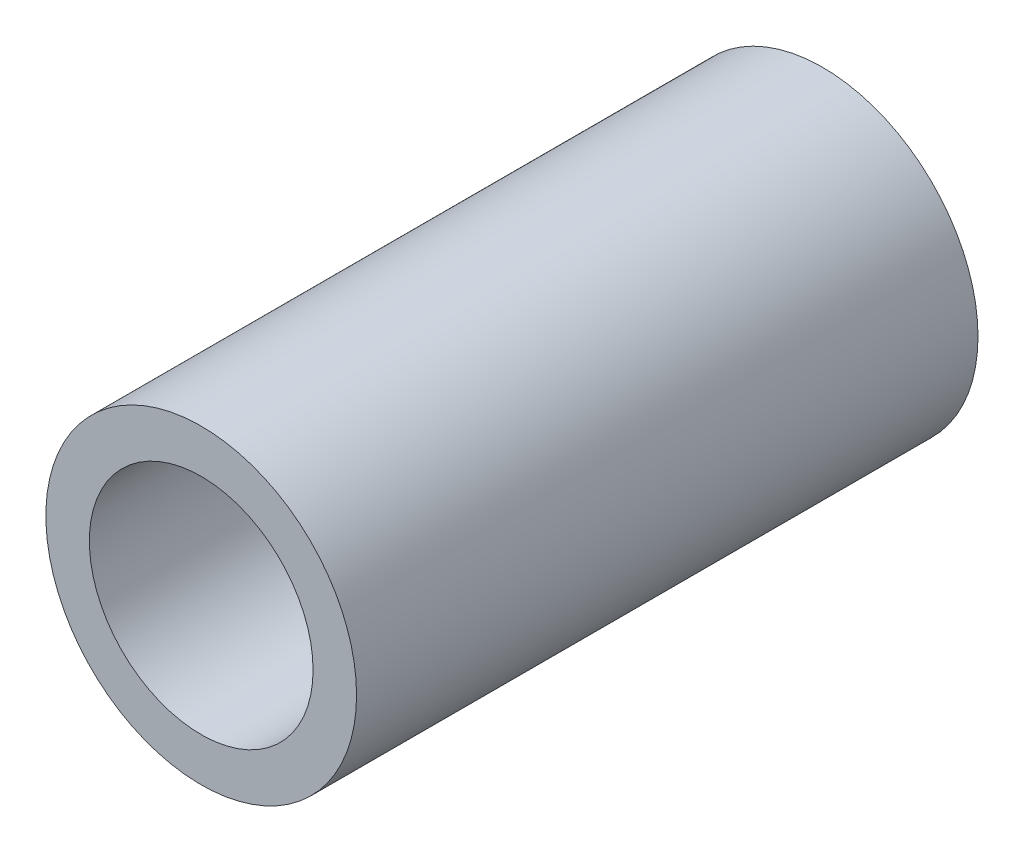
ISO-10303-21;
HEADER;
FILE_DESCRIPTION(('STEP AP214'),'2;1');
FILE_NAME('part.step','',(''),(''),'','','');
FILE_SCHEMA(('AUTOMOTIVE_DESIGN { 1 0 10303 214 1 1 1 1 }'));
ENDSEC;
DATA;
#1=APPLICATION_CONTEXT('core data for automotive mechanical design processes');
#2=APPLICATION_PROTOCOL_DEFINITION('international standard','automotive_design',2000,#1);
#3=PRODUCT_CONTEXT('',#1,'mechanical');
#4=PRODUCT('Part','Part','',(#3));
#5=PRODUCT_RELATED_PRODUCT_CATEGORY('part','',(#4));
#6=PRODUCT_DEFINITION_FORMATION('','',#4);
#7=PRODUCT_DEFINITION_CONTEXT('part definition',#1,'design');
#8=PRODUCT_DEFINITION('design','',#6,#7);
#9=PRODUCT_DEFINITION_SHAPE('','',#8);
#10=(LENGTH_UNIT() NAMED_UNIT(*) SI_UNIT(.MILLI.,.METRE.));
#11=(NAMED_UNIT(*) PLANE_ANGLE_UNIT() SI_UNIT($,.RADIAN.));
#12=(NAMED_UNIT(*) SI_UNIT($,.STERADIAN.) SOLID_ANGLE_UNIT());
#13=UNCERTAINTY_MEASURE_WITH_UNIT(LENGTH_MEASURE(1.E-05),#10,'distance_accuracy_value','');
#14=(GEOMETRIC_REPRESENTATION_CONTEXT(3) GLOBAL_UNCERTAINTY_ASSIGNED_CONTEXT((#13)) GLOBAL_UNIT_ASSIGNED_CONTEXT((#10,
#11,#12)) REPRESENTATION_CONTEXT('',''));
#15=CARTESIAN_POINT('',(0.,0.,0.));
#16=DIRECTION('',(0.,0.,1.));
#17=DIRECTION('',(1.,0.,0.));
#18=AXIS2_PLACEMENT_3D('',#15,#16,#17);
#19=CARTESIAN_POINT('',(0.,0.,3.175));
#20=DIRECTION('',(0.,0.,1.));
#21=DIRECTION('',(1.,0.,0.));
#22=AXIS2_PLACEMENT_3D('',#19,#20,#21);
#23=PLANE('',#22);
#24=CARTESIAN_POINT('',(0.,0.,3.175));
#25=DIRECTION('',(0.,0.,1.));
#26=DIRECTION('',(1.,0.,0.));
#27=AXIS2_PLACEMENT_3D('',#24,#25,#26);
#28=CIRCLE('',#27,1.5875);
#29=CARTESIAN_POINT('',(1.5875,0.,3.175));
#30=VERTEX_POINT('',#29);
#31=EDGE_CURVE('E10',#30,#30,#28,.T.);
#32=ORIENTED_EDGE('',*,*,#31,.T.);
#33=EDGE_LOOP('',(#32));
#34=FACE_BOUND('',#33,.T.);
#35=CARTESIAN_POINT('',(0.,0.,3.175));
#36=DIRECTION('',(0.,0.,1.));
#37=DIRECTION('',(1.,0.,0.));
#38=AXIS2_PLACEMENT_3D('',#35,#36,#37);
#39=CIRCLE('',#38,1.143);
#40=CARTESIAN_POINT('',(1.143,0.,3.175));
#41=VERTEX_POINT('',#40);
#42=EDGE_CURVE('E46',#41,#41,#39,.T.);
#43=ORIENTED_EDGE('',*,*,#42,.F.);
#44=EDGE_LOOP('',(#43));
#45=FACE_BOUND('',#44,.T.);
#46=ADVANCED_FACE('F35',(#34,#45),#23,.T.);
#47=CARTESIAN_POINT('',(0.,0.,-3.175));
#48=DIRECTION('',(0.,0.,1.));
#49=DIRECTION('',(1.,0.,0.));
#50=AXIS2_PLACEMENT_3D('',#47,#48,#49);
#51=PLANE('',#50);
#52=CARTESIAN_POINT('',(0.,0.,-3.175));
#53=DIRECTION('',(0.,0.,1.));
#54=DIRECTION('',(1.,0.,0.));
#55=AXIS2_PLACEMENT_3D('',#52,#53,#54);
#56=CIRCLE('',#55,1.5875);
#57=CARTESIAN_POINT('',(1.5875,0.,-3.175));
#58=VERTEX_POINT('',#57);
#59=EDGE_CURVE('E39',#58,#58,#56,.T.);
#60=ORIENTED_EDGE('',*,*,#59,.F.);
#61=EDGE_LOOP('',(#60));
#62=FACE_BOUND('',#61,.T.);
#63=CARTESIAN_POINT('',(0.,0.,-3.175));
#64=DIRECTION('',(0.,0.,1.));
#65=DIRECTION('',(1.,0.,0.));
#66=AXIS2_PLACEMENT_3D('',#63,#64,#65);
#67=CIRCLE('',#66,1.143);
#68=CARTESIAN_POINT('',(1.143,0.,-3.175));
#69=VERTEX_POINT('',#68);
#70=EDGE_CURVE('E48',#69,#69,#67,.T.);
#71=ORIENTED_EDGE('',*,*,#70,.T.);
#72=EDGE_LOOP('',(#71));
#73=FACE_BOUND('',#72,.T.);
#74=ADVANCED_FACE('F58',(#62,#73),#51,.F.);
#75=CARTESIAN_POINT('',(0.,0.,3.175));
#76=DIRECTION('',(0.,0.,-1.));
#77=DIRECTION('',(-1.,0.,0.));
#78=AXIS2_PLACEMENT_3D('',#75,#76,#77);
#79=CYLINDRICAL_SURFACE('',#78,1.5875);
#80=ORIENTED_EDGE('',*,*,#31,.F.);
#81=EDGE_LOOP('',(#80));
#82=FACE_BOUND('',#81,.T.);
#83=ORIENTED_EDGE('',*,*,#59,.T.);
#84=EDGE_LOOP('',(#83));
#85=FACE_BOUND('',#84,.T.);
#86=ADVANCED_FACE('F37',(#82,#85),#79,.T.);
#87=CARTESIAN_POINT('',(0.,0.,3.175));
#88=DIRECTION('',(0.,0.,-1.));
#89=DIRECTION('',(-1.,0.,0.));
#90=AXIS2_PLACEMENT_3D('',#87,#88,#89);
#91=CYLINDRICAL_SURFACE('',#90,1.143);
#92=ORIENTED_EDGE('',*,*,#42,.T.);
#93=EDGE_LOOP('',(#92));
#94=FACE_BOUND('',#93,.T.);
#95=ORIENTED_EDGE('',*,*,#70,.F.);
#96=EDGE_LOOP('',(#95));
#97=FACE_BOUND('',#96,.T.);
#98=ADVANCED_FACE('F54',(#94,#97),#91,.F.);
#99=CLOSED_SHELL('',(#46,#74,#86,#98));
#100=MANIFOLD_SOLID_BREP('B2',#99);
#101=ADVANCED_BREP_SHAPE_REPRESENTATION('',(#18,#100),#14);
#102=SHAPE_DEFINITION_REPRESENTATION(#9,#101);
ENDSEC;
END-ISO-10303-21;
